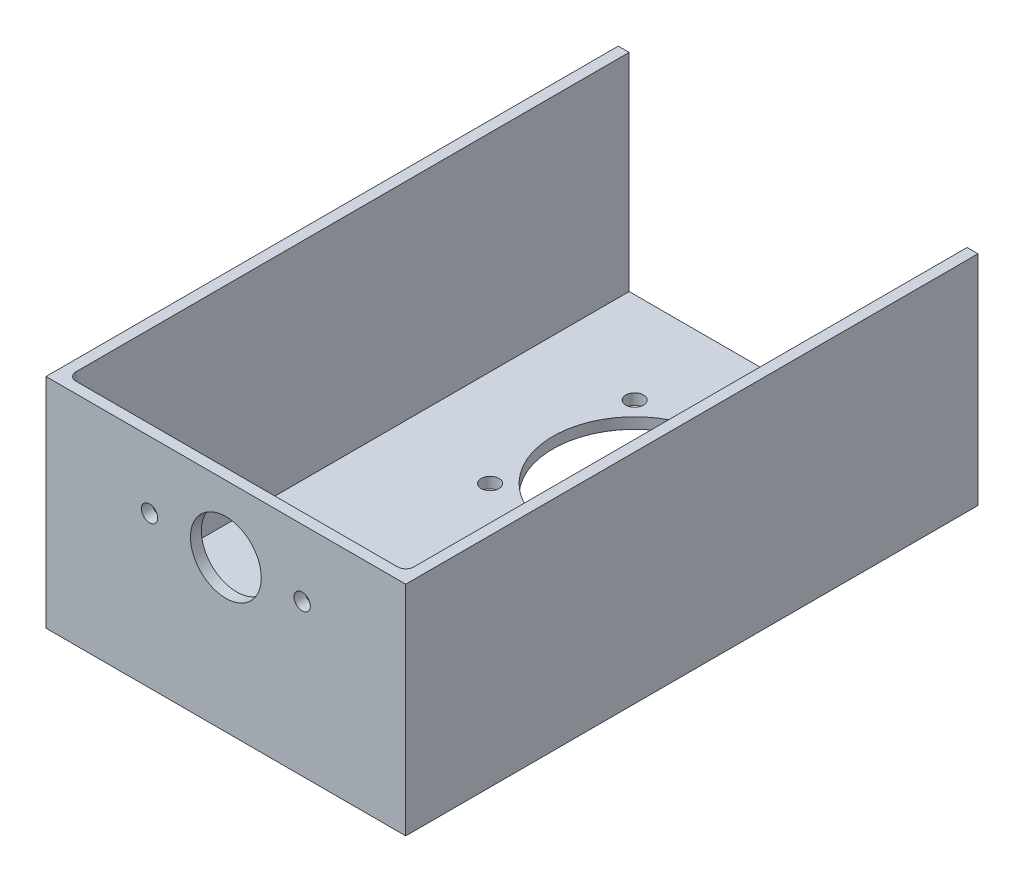
ISO-10303-21;
HEADER;
FILE_DESCRIPTION(('STEP AP214'),'2;1');
FILE_NAME('part.step','',(''),(''),'','','');
FILE_SCHEMA(('AUTOMOTIVE_DESIGN { 1 0 10303 214 1 1 1 1 }'));
ENDSEC;
DATA;
#1=APPLICATION_CONTEXT('core data for automotive mechanical design processes');
#2=APPLICATION_PROTOCOL_DEFINITION('international standard','automotive_design',2000,#1);
#3=PRODUCT_CONTEXT('',#1,'mechanical');
#4=PRODUCT('Part','Part','',(#3));
#5=PRODUCT_RELATED_PRODUCT_CATEGORY('part','',(#4));
#6=PRODUCT_DEFINITION_FORMATION('','',#4);
#7=PRODUCT_DEFINITION_CONTEXT('part definition',#1,'design');
#8=PRODUCT_DEFINITION('design','',#6,#7);
#9=PRODUCT_DEFINITION_SHAPE('','',#8);
#10=(LENGTH_UNIT() NAMED_UNIT(*) SI_UNIT(.MILLI.,.METRE.));
#11=(NAMED_UNIT(*) PLANE_ANGLE_UNIT() SI_UNIT($,.RADIAN.));
#12=(NAMED_UNIT(*) SI_UNIT($,.STERADIAN.) SOLID_ANGLE_UNIT());
#13=UNCERTAINTY_MEASURE_WITH_UNIT(LENGTH_MEASURE(1.E-05),#10,'distance_accuracy_value','');
#14=(GEOMETRIC_REPRESENTATION_CONTEXT(3) GLOBAL_UNCERTAINTY_ASSIGNED_CONTEXT((#13)) GLOBAL_UNIT_ASSIGNED_CONTEXT((#10,
#11,#12)) REPRESENTATION_CONTEXT('',''));
#15=CARTESIAN_POINT('',(0.,0.,0.));
#16=DIRECTION('',(0.,0.,1.));
#17=DIRECTION('',(1.,0.,0.));
#18=AXIS2_PLACEMENT_3D('',#15,#16,#17);
#19=CARTESIAN_POINT('',(66.,-40.,-210.));
#20=DIRECTION('',(1.,0.,0.));
#21=DIRECTION('',(0.,0.,-1.));
#22=AXIS2_PLACEMENT_3D('',#19,#20,#21);
#23=PLANE('',#22);
#24=DIRECTION('',(0.,1.,0.));
#25=VECTOR('',#24,1.);
#26=CARTESIAN_POINT('',(66.,-40.,0.));
#27=LINE('',#26,#25);
#28=CARTESIAN_POINT('',(66.,-40.,0.));
#29=VERTEX_POINT('',#28);
#30=CARTESIAN_POINT('',(66.,40.,0.));
#31=VERTEX_POINT('',#30);
#32=EDGE_CURVE('E132',#29,#31,#27,.T.);
#33=ORIENTED_EDGE('',*,*,#32,.F.);
#34=DIRECTION('',(0.,0.,1.));
#35=VECTOR('',#34,1.);
#36=CARTESIAN_POINT('',(66.,-40.,-210.));
#37=LINE('',#36,#35);
#38=CARTESIAN_POINT('',(66.,-40.,-210.));
#39=VERTEX_POINT('',#38);
#40=EDGE_CURVE('E162',#39,#29,#37,.T.);
#41=ORIENTED_EDGE('',*,*,#40,.F.);
#42=DIRECTION('',(0.,1.,0.));
#43=VECTOR('',#42,1.);
#44=CARTESIAN_POINT('',(66.,-40.,-210.));
#45=LINE('',#44,#43);
#46=CARTESIAN_POINT('',(66.,40.,-210.));
#47=VERTEX_POINT('',#46);
#48=EDGE_CURVE('E141',#39,#47,#45,.T.);
#49=ORIENTED_EDGE('',*,*,#48,.T.);
#50=DIRECTION('',(0.,0.,1.));
#51=VECTOR('',#50,1.);
#52=CARTESIAN_POINT('',(66.,40.,-210.));
#53=LINE('',#52,#51);
#54=EDGE_CURVE('E153',#47,#31,#53,.T.);
#55=ORIENTED_EDGE('',*,*,#54,.T.);
#56=EDGE_LOOP('',(#33,#41,#49,#55));
#57=FACE_BOUND('',#56,.T.);
#58=ADVANCED_FACE('F34',(#57),#23,.T.);
#59=CARTESIAN_POINT('',(-66.,-40.,-210.));
#60=DIRECTION('',(0.,-1.,0.));
#61=DIRECTION('',(0.,0.,-1.));
#62=AXIS2_PLACEMENT_3D('',#59,#60,#61);
#63=PLANE('',#62);
#64=CARTESIAN_POINT('',(-26.5165042944956,-40.,-176.516504294495));
#65=DIRECTION('',(0.,-1.,0.));
#66=DIRECTION('',(0.,0.,-1.));
#67=AXIS2_PLACEMENT_3D('',#64,#65,#66);
#68=CIRCLE('',#67,3.25);
#69=CARTESIAN_POINT('',(-26.5165042944956,-40.,-179.766504294495));
#70=VERTEX_POINT('',#69);
#71=EDGE_CURVE('E286',#70,#70,#68,.T.);
#72=ORIENTED_EDGE('',*,*,#71,.F.);
#73=EDGE_LOOP('',(#72));
#74=FACE_BOUND('',#73,.T.);
#75=CARTESIAN_POINT('',(-26.5165042944954,-40.,-123.483495705504));
#76=DIRECTION('',(0.,-1.,0.));
#77=DIRECTION('',(0.,0.,-1.));
#78=AXIS2_PLACEMENT_3D('',#75,#76,#77);
#79=CIRCLE('',#78,3.25);
#80=CARTESIAN_POINT('',(-26.5165042944954,-40.,-126.733495705504));
#81=VERTEX_POINT('',#80);
#82=EDGE_CURVE('E296',#81,#81,#79,.T.);
#83=ORIENTED_EDGE('',*,*,#82,.F.);
#84=EDGE_LOOP('',(#83));
#85=FACE_BOUND('',#84,.T.);
#86=CARTESIAN_POINT('',(26.5165042944956,-40.,-123.483495705504));
#87=DIRECTION('',(0.,-1.,0.));
#88=DIRECTION('',(0.,0.,-1.));
#89=AXIS2_PLACEMENT_3D('',#86,#87,#88);
#90=CIRCLE('',#89,3.24999999999999);
#91=CARTESIAN_POINT('',(26.5165042944956,-40.,-126.733495705504));
#92=VERTEX_POINT('',#91);
#93=EDGE_CURVE('E302',#92,#92,#90,.T.);
#94=ORIENTED_EDGE('',*,*,#93,.F.);
#95=EDGE_LOOP('',(#94));
#96=FACE_BOUND('',#95,.T.);
#97=CARTESIAN_POINT('',(3.78169717762944E-13,-40.,-150.));
#98=DIRECTION('',(0.,-1.,0.));
#99=DIRECTION('',(0.,0.,-1.));
#100=AXIS2_PLACEMENT_3D('',#97,#98,#99);
#101=CIRCLE('',#100,29.9999999999998);
#102=CARTESIAN_POINT('',(3.78169717762944E-13,-40.,-179.999999999999));
#103=VERTEX_POINT('',#102);
#104=EDGE_CURVE('E308',#103,#103,#101,.T.);
#105=ORIENTED_EDGE('',*,*,#104,.F.);
#106=EDGE_LOOP('',(#105));
#107=FACE_BOUND('',#106,.T.);
#108=CARTESIAN_POINT('',(26.5165042944955,-40.,-176.516504294496));
#109=DIRECTION('',(0.,-1.,0.));
#110=DIRECTION('',(0.,0.,-1.));
#111=AXIS2_PLACEMENT_3D('',#108,#109,#110);
#112=CIRCLE('',#111,3.25);
#113=CARTESIAN_POINT('',(26.5165042944955,-40.,-179.766504294496));
#114=VERTEX_POINT('',#113);
#115=EDGE_CURVE('E314',#114,#114,#112,.T.);
#116=ORIENTED_EDGE('',*,*,#115,.F.);
#117=EDGE_LOOP('',(#116));
#118=FACE_BOUND('',#117,.T.);
#119=DIRECTION('',(1.,0.,0.));
#120=VECTOR('',#119,1.);
#121=CARTESIAN_POINT('',(-66.,-40.,0.));
#122=LINE('',#121,#120);
#123=CARTESIAN_POINT('',(-66.,-40.,0.));
#124=VERTEX_POINT('',#123);
#125=EDGE_CURVE('E144',#124,#29,#122,.T.);
#126=ORIENTED_EDGE('',*,*,#125,.F.);
#127=DIRECTION('',(0.,0.,1.));
#128=VECTOR('',#127,1.);
#129=CARTESIAN_POINT('',(-66.,-40.,-210.));
#130=LINE('',#129,#128);
#131=CARTESIAN_POINT('',(-66.,-40.,-210.));
#132=VERTEX_POINT('',#131);
#133=EDGE_CURVE('E165',#132,#124,#130,.T.);
#134=ORIENTED_EDGE('',*,*,#133,.F.);
#135=DIRECTION('',(1.,0.,0.));
#136=VECTOR('',#135,1.);
#137=CARTESIAN_POINT('',(-66.,-40.,-210.));
#138=LINE('',#137,#136);
#139=EDGE_CURVE('E151',#132,#39,#138,.T.);
#140=ORIENTED_EDGE('',*,*,#139,.T.);
#141=ORIENTED_EDGE('',*,*,#40,.T.);
#142=EDGE_LOOP('',(#126,#134,#140,#141));
#143=FACE_BOUND('',#142,.T.);
#144=ADVANCED_FACE('F219',(#74,#85,#96,#107,#118,#143),#63,.T.);
#145=CARTESIAN_POINT('',(-66.,-40.,-210.));
#146=DIRECTION('',(-1.,0.,0.));
#147=DIRECTION('',(0.,0.,1.));
#148=AXIS2_PLACEMENT_3D('',#145,#146,#147);
#149=PLANE('',#148);
#150=DIRECTION('',(0.,-1.,0.));
#151=VECTOR('',#150,1.);
#152=CARTESIAN_POINT('',(-66.,-40.,0.));
#153=LINE('',#152,#151);
#154=CARTESIAN_POINT('',(-66.,40.,0.));
#155=VERTEX_POINT('',#154);
#156=EDGE_CURVE('E157',#155,#124,#153,.T.);
#157=ORIENTED_EDGE('',*,*,#156,.F.);
#158=DIRECTION('',(0.,0.,1.));
#159=VECTOR('',#158,1.);
#160=CARTESIAN_POINT('',(-66.,40.,-210.));
#161=LINE('',#160,#159);
#162=CARTESIAN_POINT('',(-66.,40.,-210.));
#163=VERTEX_POINT('',#162);
#164=EDGE_CURVE('E167',#163,#155,#161,.T.);
#165=ORIENTED_EDGE('',*,*,#164,.F.);
#166=DIRECTION('',(0.,-1.,0.));
#167=VECTOR('',#166,1.);
#168=CARTESIAN_POINT('',(-66.,-40.,-210.));
#169=LINE('',#168,#167);
#170=EDGE_CURVE('E148',#163,#132,#169,.T.);
#171=ORIENTED_EDGE('',*,*,#170,.T.);
#172=ORIENTED_EDGE('',*,*,#133,.T.);
#173=EDGE_LOOP('',(#157,#165,#171,#172));
#174=FACE_BOUND('',#173,.T.);
#175=ADVANCED_FACE('F225',(#174),#149,.T.);
#176=CARTESIAN_POINT('',(-66.,40.,-210.));
#177=DIRECTION('',(0.,1.,0.));
#178=DIRECTION('',(0.,0.,1.));
#179=AXIS2_PLACEMENT_3D('',#176,#177,#178);
#180=PLANE('',#179);
#181=DIRECTION('',(0.,0.,1.));
#182=VECTOR('',#181,1.);
#183=CARTESIAN_POINT('',(-62.,40.,-4.));
#184=LINE('',#183,#182);
#185=CARTESIAN_POINT('',(-62.0000000000001,40.,-210.));
#186=VERTEX_POINT('',#185);
#187=CARTESIAN_POINT('',(-62.,40.,-7.));
#188=VERTEX_POINT('',#187);
#189=EDGE_CURVE('E173',#186,#188,#184,.T.);
#190=ORIENTED_EDGE('',*,*,#189,.F.);
#191=DIRECTION('',(-1.,0.,0.));
#192=VECTOR('',#191,1.);
#193=CARTESIAN_POINT('',(-66.,40.,-210.));
#194=LINE('',#193,#192);
#195=EDGE_CURVE('E131',#186,#163,#194,.T.);
#196=ORIENTED_EDGE('',*,*,#195,.T.);
#197=ORIENTED_EDGE('',*,*,#164,.T.);
#198=DIRECTION('',(-1.,0.,0.));
#199=VECTOR('',#198,1.);
#200=CARTESIAN_POINT('',(-66.,40.,0.));
#201=LINE('',#200,#199);
#202=EDGE_CURVE('E135',#31,#155,#201,.T.);
#203=ORIENTED_EDGE('',*,*,#202,.F.);
#204=ORIENTED_EDGE('',*,*,#54,.F.);
#205=CARTESIAN_POINT('',(62.0000000000001,40.,-210.));
#206=VERTEX_POINT('',#205);
#207=EDGE_CURVE('E145',#47,#206,#194,.T.);
#208=ORIENTED_EDGE('',*,*,#207,.T.);
#209=DIRECTION('',(0.,0.,-1.));
#210=VECTOR('',#209,1.);
#211=CARTESIAN_POINT('',(62.,40.,-4.));
#212=LINE('',#211,#210);
#213=CARTESIAN_POINT('',(62.,40.,-7.));
#214=VERTEX_POINT('',#213);
#215=EDGE_CURVE('E115',#214,#206,#212,.T.);
#216=ORIENTED_EDGE('',*,*,#215,.F.);
#217=CARTESIAN_POINT('',(59.,40.,-7.));
#218=DIRECTION('',(0.,1.,0.));
#219=DIRECTION('',(0.,0.,1.));
#220=AXIS2_PLACEMENT_3D('',#217,#218,#219);
#221=CIRCLE('',#220,3.);
#222=CARTESIAN_POINT('',(59.,40.,-4.));
#223=VERTEX_POINT('',#222);
#224=EDGE_CURVE('E42',#214,#223,#221,.F.);
#225=ORIENTED_EDGE('',*,*,#224,.T.);
#226=DIRECTION('',(1.,0.,0.));
#227=VECTOR('',#226,1.);
#228=CARTESIAN_POINT('',(-62.,40.,-4.));
#229=LINE('',#228,#227);
#230=CARTESIAN_POINT('',(-59.,40.,-4.));
#231=VERTEX_POINT('',#230);
#232=EDGE_CURVE('E197',#231,#223,#229,.T.);
#233=ORIENTED_EDGE('',*,*,#232,.F.);
#234=CARTESIAN_POINT('',(-59.,40.,-7.));
#235=DIRECTION('',(0.,1.,0.));
#236=DIRECTION('',(0.,0.,1.));
#237=AXIS2_PLACEMENT_3D('',#234,#235,#236);
#238=CIRCLE('',#237,3.);
#239=EDGE_CURVE('E11',#231,#188,#238,.F.);
#240=ORIENTED_EDGE('',*,*,#239,.T.);
#241=EDGE_LOOP('',(#190,#196,#197,#203,#204,#208,#216,#225,#233,#240));
#242=FACE_BOUND('',#241,.T.);
#243=ADVANCED_FACE('F196',(#242),#180,.T.);
#244=CARTESIAN_POINT('',(0.,0.,-210.));
#245=DIRECTION('',(0.,0.,-1.));
#246=DIRECTION('',(-1.,0.,0.));
#247=AXIS2_PLACEMENT_3D('',#244,#245,#246);
#248=PLANE('',#247);
#249=DIRECTION('',(0.,1.,0.));
#250=VECTOR('',#249,1.);
#251=CARTESIAN_POINT('',(-62.0000000000001,-36.,-210.));
#252=LINE('',#251,#250);
#253=CARTESIAN_POINT('',(-62.0000000000001,-36.,-210.));
#254=VERTEX_POINT('',#253);
#255=EDGE_CURVE('E111',#254,#186,#252,.T.);
#256=ORIENTED_EDGE('',*,*,#255,.F.);
#257=DIRECTION('',(-1.,0.,0.));
#258=VECTOR('',#257,1.);
#259=CARTESIAN_POINT('',(-62.0000000000001,-36.,-210.));
#260=LINE('',#259,#258);
#261=CARTESIAN_POINT('',(62.0000000000001,-36.,-210.));
#262=VERTEX_POINT('',#261);
#263=EDGE_CURVE('E118',#262,#254,#260,.T.);
#264=ORIENTED_EDGE('',*,*,#263,.F.);
#265=DIRECTION('',(0.,1.,0.));
#266=VECTOR('',#265,1.);
#267=CARTESIAN_POINT('',(62.0000000000001,-36.,-210.));
#268=LINE('',#267,#266);
#269=EDGE_CURVE('E126',#262,#206,#268,.T.);
#270=ORIENTED_EDGE('',*,*,#269,.T.);
#271=ORIENTED_EDGE('',*,*,#207,.F.);
#272=ORIENTED_EDGE('',*,*,#48,.F.);
#273=ORIENTED_EDGE('',*,*,#139,.F.);
#274=ORIENTED_EDGE('',*,*,#170,.F.);
#275=ORIENTED_EDGE('',*,*,#195,.F.);
#276=EDGE_LOOP('',(#256,#264,#270,#271,#272,#273,#274,#275));
#277=FACE_BOUND('',#276,.T.);
#278=ADVANCED_FACE('F129',(#277),#248,.T.);
#279=CARTESIAN_POINT('',(0.,0.,0.));
#280=DIRECTION('',(0.,0.,-1.));
#281=DIRECTION('',(-1.,0.,0.));
#282=AXIS2_PLACEMENT_3D('',#279,#280,#281);
#283=PLANE('',#282);
#284=CARTESIAN_POINT('',(28.,15.5,0.));
#285=DIRECTION('',(0.,0.,1.));
#286=DIRECTION('',(-1.,0.,0.));
#287=AXIS2_PLACEMENT_3D('',#284,#285,#286);
#288=CIRCLE('',#287,3.);
#289=CARTESIAN_POINT('',(25.,15.5,0.));
#290=VERTEX_POINT('',#289);
#291=EDGE_CURVE('E182',#290,#290,#288,.T.);
#292=ORIENTED_EDGE('',*,*,#291,.F.);
#293=EDGE_LOOP('',(#292));
#294=FACE_BOUND('',#293,.T.);
#295=CARTESIAN_POINT('',(-28.,15.5,0.));
#296=DIRECTION('',(0.,0.,1.));
#297=DIRECTION('',(1.,0.,0.));
#298=AXIS2_PLACEMENT_3D('',#295,#296,#297);
#299=CIRCLE('',#298,3.);
#300=CARTESIAN_POINT('',(-25.,15.5,0.));
#301=VERTEX_POINT('',#300);
#302=EDGE_CURVE('E178',#301,#301,#299,.T.);
#303=ORIENTED_EDGE('',*,*,#302,.F.);
#304=EDGE_LOOP('',(#303));
#305=FACE_BOUND('',#304,.T.);
#306=CARTESIAN_POINT('',(0.,15.5,0.));
#307=DIRECTION('',(0.,0.,1.));
#308=DIRECTION('',(1.,0.,0.));
#309=AXIS2_PLACEMENT_3D('',#306,#307,#308);
#310=CIRCLE('',#309,13.);
#311=CARTESIAN_POINT('',(13.,15.5,0.));
#312=VERTEX_POINT('',#311);
#313=EDGE_CURVE('E174',#312,#312,#310,.T.);
#314=ORIENTED_EDGE('',*,*,#313,.F.);
#315=EDGE_LOOP('',(#314));
#316=FACE_BOUND('',#315,.T.);
#317=ORIENTED_EDGE('',*,*,#32,.T.);
#318=ORIENTED_EDGE('',*,*,#202,.T.);
#319=ORIENTED_EDGE('',*,*,#156,.T.);
#320=ORIENTED_EDGE('',*,*,#125,.T.);
#321=EDGE_LOOP('',(#317,#318,#319,#320));
#322=FACE_BOUND('',#321,.T.);
#323=ADVANCED_FACE('F235',(#294,#305,#316,#322),#283,.F.);
#324=CARTESIAN_POINT('',(-62.,-36.,-4.));
#325=DIRECTION('',(-1.,0.,0.));
#326=DIRECTION('',(0.,0.,1.));
#327=AXIS2_PLACEMENT_3D('',#324,#325,#326);
#328=PLANE('',#327);
#329=ORIENTED_EDGE('',*,*,#189,.T.);
#330=DIRECTION('',(0.,1.,0.));
#331=VECTOR('',#330,1.);
#332=CARTESIAN_POINT('',(-62.,-36.,-7.));
#333=LINE('',#332,#331);
#334=CARTESIAN_POINT('',(-62.,-36.,-7.));
#335=VERTEX_POINT('',#334);
#336=EDGE_CURVE('E54',#188,#335,#333,.F.);
#337=ORIENTED_EDGE('',*,*,#336,.T.);
#338=DIRECTION('',(0.,0.,1.));
#339=VECTOR('',#338,1.);
#340=CARTESIAN_POINT('',(-62.,-36.,-4.));
#341=LINE('',#340,#339);
#342=EDGE_CURVE('E107',#254,#335,#341,.T.);
#343=ORIENTED_EDGE('',*,*,#342,.F.);
#344=ORIENTED_EDGE('',*,*,#255,.T.);
#345=EDGE_LOOP('',(#329,#337,#343,#344));
#346=FACE_BOUND('',#345,.T.);
#347=ADVANCED_FACE('F109',(#346),#328,.F.);
#348=CARTESIAN_POINT('',(62.,-36.,-4.));
#349=DIRECTION('',(1.,0.,0.));
#350=DIRECTION('',(0.,0.,-1.));
#351=AXIS2_PLACEMENT_3D('',#348,#349,#350);
#352=PLANE('',#351);
#353=DIRECTION('',(0.,0.,-1.));
#354=VECTOR('',#353,1.);
#355=CARTESIAN_POINT('',(62.,-36.,-4.));
#356=LINE('',#355,#354);
#357=CARTESIAN_POINT('',(62.,-36.,-7.));
#358=VERTEX_POINT('',#357);
#359=EDGE_CURVE('E122',#358,#262,#356,.T.);
#360=ORIENTED_EDGE('',*,*,#359,.F.);
#361=DIRECTION('',(0.,1.,0.));
#362=VECTOR('',#361,1.);
#363=CARTESIAN_POINT('',(62.,40.,-7.));
#364=LINE('',#363,#362);
#365=EDGE_CURVE('E164',#358,#214,#364,.T.);
#366=ORIENTED_EDGE('',*,*,#365,.T.);
#367=ORIENTED_EDGE('',*,*,#215,.T.);
#368=ORIENTED_EDGE('',*,*,#269,.F.);
#369=EDGE_LOOP('',(#360,#366,#367,#368));
#370=FACE_BOUND('',#369,.T.);
#371=ADVANCED_FACE('F208',(#370),#352,.F.);
#372=CARTESIAN_POINT('',(-62.,-36.,-4.));
#373=DIRECTION('',(0.,0.,1.));
#374=DIRECTION('',(1.,0.,0.));
#375=AXIS2_PLACEMENT_3D('',#372,#373,#374);
#376=PLANE('',#375);
#377=CARTESIAN_POINT('',(28.,15.5,-4.));
#378=DIRECTION('',(0.,0.,1.));
#379=DIRECTION('',(1.,0.,0.));
#380=AXIS2_PLACEMENT_3D('',#377,#378,#379);
#381=CIRCLE('',#380,3.);
#382=CARTESIAN_POINT('',(31.,15.5,-4.));
#383=VERTEX_POINT('',#382);
#384=EDGE_CURVE('E179',#383,#383,#381,.T.);
#385=ORIENTED_EDGE('',*,*,#384,.T.);
#386=EDGE_LOOP('',(#385));
#387=FACE_BOUND('',#386,.T.);
#388=CARTESIAN_POINT('',(-28.,15.5,-4.));
#389=DIRECTION('',(0.,0.,1.));
#390=DIRECTION('',(1.,0.,0.));
#391=AXIS2_PLACEMENT_3D('',#388,#389,#390);
#392=CIRCLE('',#391,3.);
#393=CARTESIAN_POINT('',(-25.,15.5,-4.));
#394=VERTEX_POINT('',#393);
#395=EDGE_CURVE('E175',#394,#394,#392,.T.);
#396=ORIENTED_EDGE('',*,*,#395,.T.);
#397=EDGE_LOOP('',(#396));
#398=FACE_BOUND('',#397,.T.);
#399=CARTESIAN_POINT('',(0.,15.5,-4.));
#400=DIRECTION('',(0.,0.,1.));
#401=DIRECTION('',(1.,0.,0.));
#402=AXIS2_PLACEMENT_3D('',#399,#400,#401);
#403=CIRCLE('',#402,13.);
#404=CARTESIAN_POINT('',(13.,15.5,-4.));
#405=VERTEX_POINT('',#404);
#406=EDGE_CURVE('E170',#405,#405,#403,.T.);
#407=ORIENTED_EDGE('',*,*,#406,.T.);
#408=EDGE_LOOP('',(#407));
#409=FACE_BOUND('',#408,.T.);
#410=ORIENTED_EDGE('',*,*,#232,.T.);
#411=DIRECTION('',(0.,1.,0.));
#412=VECTOR('',#411,1.);
#413=CARTESIAN_POINT('',(59.,-36.,-4.));
#414=LINE('',#413,#412);
#415=CARTESIAN_POINT('',(59.,-36.,-4.));
#416=VERTEX_POINT('',#415);
#417=EDGE_CURVE('E188',#223,#416,#414,.F.);
#418=ORIENTED_EDGE('',*,*,#417,.T.);
#419=DIRECTION('',(1.,0.,0.));
#420=VECTOR('',#419,1.);
#421=CARTESIAN_POINT('',(-62.,-36.,-4.));
#422=LINE('',#421,#420);
#423=CARTESIAN_POINT('',(-59.,-36.,-4.));
#424=VERTEX_POINT('',#423);
#425=EDGE_CURVE('E114',#424,#416,#422,.T.);
#426=ORIENTED_EDGE('',*,*,#425,.F.);
#427=DIRECTION('',(0.,1.,0.));
#428=VECTOR('',#427,1.);
#429=CARTESIAN_POINT('',(-59.,40.,-4.));
#430=LINE('',#429,#428);
#431=EDGE_CURVE('E185',#424,#231,#430,.T.);
#432=ORIENTED_EDGE('',*,*,#431,.T.);
#433=EDGE_LOOP('',(#410,#418,#426,#432));
#434=FACE_BOUND('',#433,.T.);
#435=ADVANCED_FACE('F202',(#387,#398,#409,#434),#376,.F.);
#436=CARTESIAN_POINT('',(0.,-36.,0.));
#437=DIRECTION('',(0.,-1.,0.));
#438=DIRECTION('',(0.,0.,-1.));
#439=AXIS2_PLACEMENT_3D('',#436,#437,#438);
#440=PLANE('',#439);
#441=CARTESIAN_POINT('',(-26.5165042944956,-36.,-176.516504294495));
#442=DIRECTION('',(0.,1.,0.));
#443=DIRECTION('',(0.,0.,1.));
#444=AXIS2_PLACEMENT_3D('',#441,#442,#443);
#445=CIRCLE('',#444,3.25);
#446=CARTESIAN_POINT('',(-26.5165042944956,-36.,-173.266504294495));
#447=VERTEX_POINT('',#446);
#448=EDGE_CURVE('E289',#447,#447,#445,.T.);
#449=ORIENTED_EDGE('',*,*,#448,.F.);
#450=EDGE_LOOP('',(#449));
#451=FACE_BOUND('',#450,.T.);
#452=CARTESIAN_POINT('',(-26.5165042944954,-36.,-123.483495705504));
#453=DIRECTION('',(0.,1.,0.));
#454=DIRECTION('',(0.,0.,1.));
#455=AXIS2_PLACEMENT_3D('',#452,#453,#454);
#456=CIRCLE('',#455,3.25);
#457=CARTESIAN_POINT('',(-26.5165042944954,-36.,-120.233495705504));
#458=VERTEX_POINT('',#457);
#459=EDGE_CURVE('E291',#458,#458,#456,.T.);
#460=ORIENTED_EDGE('',*,*,#459,.F.);
#461=EDGE_LOOP('',(#460));
#462=FACE_BOUND('',#461,.T.);
#463=CARTESIAN_POINT('',(26.5165042944956,-36.,-123.483495705504));
#464=DIRECTION('',(0.,1.,0.));
#465=DIRECTION('',(0.,0.,1.));
#466=AXIS2_PLACEMENT_3D('',#463,#464,#465);
#467=CIRCLE('',#466,3.24999999999999);
#468=CARTESIAN_POINT('',(26.5165042944956,-36.,-120.233495705504));
#469=VERTEX_POINT('',#468);
#470=EDGE_CURVE('E299',#469,#469,#467,.T.);
#471=ORIENTED_EDGE('',*,*,#470,.F.);
#472=EDGE_LOOP('',(#471));
#473=FACE_BOUND('',#472,.T.);
#474=CARTESIAN_POINT('',(3.78169717762944E-13,-36.,-150.));
#475=DIRECTION('',(0.,1.,0.));
#476=DIRECTION('',(0.,0.,1.));
#477=AXIS2_PLACEMENT_3D('',#474,#475,#476);
#478=CIRCLE('',#477,29.9999999999998);
#479=CARTESIAN_POINT('',(3.78169717762944E-13,-36.,-120.));
#480=VERTEX_POINT('',#479);
#481=EDGE_CURVE('E305',#480,#480,#478,.T.);
#482=ORIENTED_EDGE('',*,*,#481,.F.);
#483=EDGE_LOOP('',(#482));
#484=FACE_BOUND('',#483,.T.);
#485=CARTESIAN_POINT('',(26.5165042944955,-36.,-176.516504294496));
#486=DIRECTION('',(0.,1.,0.));
#487=DIRECTION('',(0.,0.,1.));
#488=AXIS2_PLACEMENT_3D('',#485,#486,#487);
#489=CIRCLE('',#488,3.25);
#490=CARTESIAN_POINT('',(26.5165042944955,-36.,-173.266504294496));
#491=VERTEX_POINT('',#490);
#492=EDGE_CURVE('E311',#491,#491,#489,.T.);
#493=ORIENTED_EDGE('',*,*,#492,.F.);
#494=EDGE_LOOP('',(#493));
#495=FACE_BOUND('',#494,.T.);
#496=ORIENTED_EDGE('',*,*,#425,.T.);
#497=CARTESIAN_POINT('',(59.,-36.,-7.));
#498=DIRECTION('',(0.,-1.,0.));
#499=DIRECTION('',(0.,0.,-1.));
#500=AXIS2_PLACEMENT_3D('',#497,#498,#499);
#501=CIRCLE('',#500,3.);
#502=EDGE_CURVE('E192',#416,#358,#501,.F.);
#503=ORIENTED_EDGE('',*,*,#502,.T.);
#504=ORIENTED_EDGE('',*,*,#359,.T.);
#505=ORIENTED_EDGE('',*,*,#263,.T.);
#506=ORIENTED_EDGE('',*,*,#342,.T.);
#507=CARTESIAN_POINT('',(-59.,-36.,-7.));
#508=DIRECTION('',(0.,-1.,0.));
#509=DIRECTION('',(0.,0.,-1.));
#510=AXIS2_PLACEMENT_3D('',#507,#508,#509);
#511=CIRCLE('',#510,3.);
#512=EDGE_CURVE('E190',#335,#424,#511,.F.);
#513=ORIENTED_EDGE('',*,*,#512,.T.);
#514=EDGE_LOOP('',(#496,#503,#504,#505,#506,#513));
#515=FACE_BOUND('',#514,.T.);
#516=ADVANCED_FACE('F120',(#451,#462,#473,#484,#495,#515),#440,.F.);
#517=CARTESIAN_POINT('',(0.,15.5,-10.));
#518=DIRECTION('',(0.,0.,1.));
#519=DIRECTION('',(1.,0.,0.));
#520=AXIS2_PLACEMENT_3D('',#517,#518,#519);
#521=CYLINDRICAL_SURFACE('',#520,13.);
#522=ORIENTED_EDGE('',*,*,#313,.T.);
#523=EDGE_LOOP('',(#522));
#524=FACE_BOUND('',#523,.T.);
#525=ORIENTED_EDGE('',*,*,#406,.F.);
#526=EDGE_LOOP('',(#525));
#527=FACE_BOUND('',#526,.T.);
#528=ADVANCED_FACE('F250',(#524,#527),#521,.F.);
#529=CARTESIAN_POINT('',(-28.,15.5,-10.));
#530=DIRECTION('',(0.,0.,1.));
#531=DIRECTION('',(1.,0.,0.));
#532=AXIS2_PLACEMENT_3D('',#529,#530,#531);
#533=CYLINDRICAL_SURFACE('',#532,3.);
#534=ORIENTED_EDGE('',*,*,#302,.T.);
#535=EDGE_LOOP('',(#534));
#536=FACE_BOUND('',#535,.T.);
#537=ORIENTED_EDGE('',*,*,#395,.F.);
#538=EDGE_LOOP('',(#537));
#539=FACE_BOUND('',#538,.T.);
#540=ADVANCED_FACE('F254',(#536,#539),#533,.F.);
#541=CARTESIAN_POINT('',(28.,15.5,-10.));
#542=DIRECTION('',(0.,0.,1.));
#543=DIRECTION('',(1.,0.,0.));
#544=AXIS2_PLACEMENT_3D('',#541,#542,#543);
#545=CYLINDRICAL_SURFACE('',#544,3.);
#546=ORIENTED_EDGE('',*,*,#291,.T.);
#547=EDGE_LOOP('',(#546));
#548=FACE_BOUND('',#547,.T.);
#549=ORIENTED_EDGE('',*,*,#384,.F.);
#550=EDGE_LOOP('',(#549));
#551=FACE_BOUND('',#550,.T.);
#552=ADVANCED_FACE('F258',(#548,#551),#545,.F.);
#553=CARTESIAN_POINT('',(26.5165042944955,-46.,-176.516504294496));
#554=DIRECTION('',(0.,1.,0.));
#555=DIRECTION('',(0.,0.,1.));
#556=AXIS2_PLACEMENT_3D('',#553,#554,#555);
#557=CYLINDRICAL_SURFACE('',#556,3.25);
#558=ORIENTED_EDGE('',*,*,#115,.T.);
#559=EDGE_LOOP('',(#558));
#560=FACE_BOUND('',#559,.T.);
#561=ORIENTED_EDGE('',*,*,#492,.T.);
#562=EDGE_LOOP('',(#561));
#563=FACE_BOUND('',#562,.T.);
#564=ADVANCED_FACE('F262',(#560,#563),#557,.F.);
#565=CARTESIAN_POINT('',(3.78169717762944E-13,-46.,-150.));
#566=DIRECTION('',(0.,1.,0.));
#567=DIRECTION('',(0.,0.,1.));
#568=AXIS2_PLACEMENT_3D('',#565,#566,#567);
#569=CYLINDRICAL_SURFACE('',#568,29.9999999999998);
#570=ORIENTED_EDGE('',*,*,#104,.T.);
#571=EDGE_LOOP('',(#570));
#572=FACE_BOUND('',#571,.T.);
#573=ORIENTED_EDGE('',*,*,#481,.T.);
#574=EDGE_LOOP('',(#573));
#575=FACE_BOUND('',#574,.T.);
#576=ADVANCED_FACE('F266',(#572,#575),#569,.F.);
#577=CARTESIAN_POINT('',(26.5165042944956,-46.,-123.483495705504));
#578=DIRECTION('',(0.,1.,0.));
#579=DIRECTION('',(0.,0.,1.));
#580=AXIS2_PLACEMENT_3D('',#577,#578,#579);
#581=CYLINDRICAL_SURFACE('',#580,3.24999999999999);
#582=ORIENTED_EDGE('',*,*,#93,.T.);
#583=EDGE_LOOP('',(#582));
#584=FACE_BOUND('',#583,.T.);
#585=ORIENTED_EDGE('',*,*,#470,.T.);
#586=EDGE_LOOP('',(#585));
#587=FACE_BOUND('',#586,.T.);
#588=ADVANCED_FACE('F270',(#584,#587),#581,.F.);
#589=CARTESIAN_POINT('',(-26.5165042944954,-46.,-123.483495705504));
#590=DIRECTION('',(0.,1.,0.));
#591=DIRECTION('',(0.,0.,1.));
#592=AXIS2_PLACEMENT_3D('',#589,#590,#591);
#593=CYLINDRICAL_SURFACE('',#592,3.25);
#594=ORIENTED_EDGE('',*,*,#82,.T.);
#595=EDGE_LOOP('',(#594));
#596=FACE_BOUND('',#595,.T.);
#597=ORIENTED_EDGE('',*,*,#459,.T.);
#598=EDGE_LOOP('',(#597));
#599=FACE_BOUND('',#598,.T.);
#600=ADVANCED_FACE('F274',(#596,#599),#593,.F.);
#601=CARTESIAN_POINT('',(-26.5165042944956,-46.,-176.516504294495));
#602=DIRECTION('',(0.,1.,0.));
#603=DIRECTION('',(0.,0.,1.));
#604=AXIS2_PLACEMENT_3D('',#601,#602,#603);
#605=CYLINDRICAL_SURFACE('',#604,3.25);
#606=ORIENTED_EDGE('',*,*,#71,.T.);
#607=EDGE_LOOP('',(#606));
#608=FACE_BOUND('',#607,.T.);
#609=ORIENTED_EDGE('',*,*,#448,.T.);
#610=EDGE_LOOP('',(#609));
#611=FACE_BOUND('',#610,.T.);
#612=ADVANCED_FACE('F217',(#608,#611),#605,.F.);
#613=CARTESIAN_POINT('',(59.,-36.,-7.));
#614=DIRECTION('',(0.,-1.,0.));
#615=DIRECTION('',(0.,0.,-1.));
#616=AXIS2_PLACEMENT_3D('',#613,#614,#615);
#617=CYLINDRICAL_SURFACE('',#616,3.);
#618=ORIENTED_EDGE('',*,*,#502,.F.);
#619=ORIENTED_EDGE('',*,*,#417,.F.);
#620=ORIENTED_EDGE('',*,*,#224,.F.);
#621=ORIENTED_EDGE('',*,*,#365,.F.);
#622=EDGE_LOOP('',(#618,#619,#620,#621));
#623=FACE_BOUND('',#622,.T.);
#624=ADVANCED_FACE('F206',(#623),#617,.F.);
#625=CARTESIAN_POINT('',(-59.,-36.,-7.));
#626=DIRECTION('',(0.,-1.,0.));
#627=DIRECTION('',(0.,0.,-1.));
#628=AXIS2_PLACEMENT_3D('',#625,#626,#627);
#629=CYLINDRICAL_SURFACE('',#628,3.);
#630=ORIENTED_EDGE('',*,*,#512,.F.);
#631=ORIENTED_EDGE('',*,*,#336,.F.);
#632=ORIENTED_EDGE('',*,*,#239,.F.);
#633=ORIENTED_EDGE('',*,*,#431,.F.);
#634=EDGE_LOOP('',(#630,#631,#632,#633));
#635=FACE_BOUND('',#634,.T.);
#636=ADVANCED_FACE('F36',(#635),#629,.F.);
#637=CLOSED_SHELL('',(#58,#144,#175,#243,#278,#323,#347,#371,#435,#516,#528,#540,#552,#564,#576,
#588,#600,#612,#624,#636));
#638=MANIFOLD_SOLID_BREP('B2',#637);
#639=ADVANCED_BREP_SHAPE_REPRESENTATION('',(#18,#638),#14);
#640=SHAPE_DEFINITION_REPRESENTATION(#9,#639);
ENDSEC;
END-ISO-10303-21;
